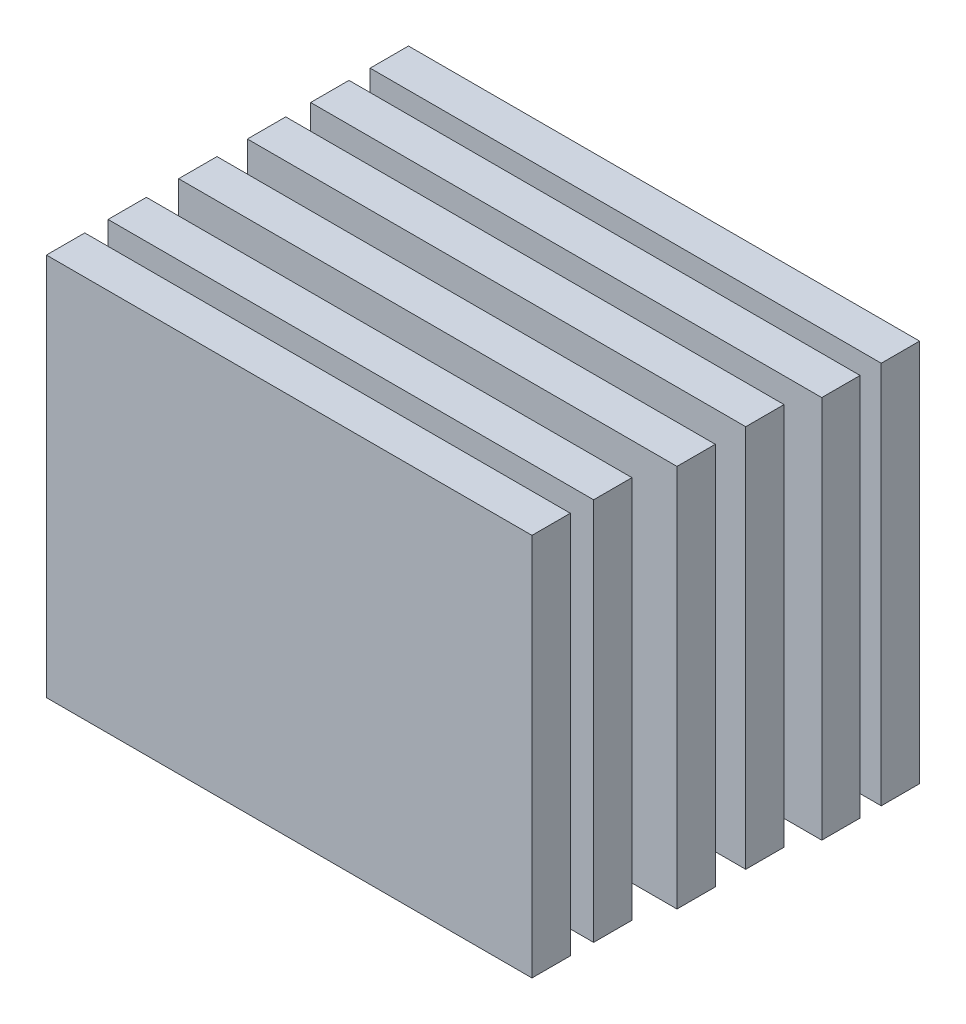
ISO-10303-21;
HEADER;
FILE_DESCRIPTION(('STEP AP214'),'2;1');
FILE_NAME('part.step','',(''),(''),'','','');
FILE_SCHEMA(('AUTOMOTIVE_DESIGN { 1 0 10303 214 1 1 1 1 }'));
ENDSEC;
DATA;
#1=APPLICATION_CONTEXT('core data for automotive mechanical design processes');
#2=APPLICATION_PROTOCOL_DEFINITION('international standard','automotive_design',2000,#1);
#3=PRODUCT_CONTEXT('',#1,'mechanical');
#4=PRODUCT('Part','Part','',(#3));
#5=PRODUCT_RELATED_PRODUCT_CATEGORY('part','',(#4));
#6=PRODUCT_DEFINITION_FORMATION('','',#4);
#7=PRODUCT_DEFINITION_CONTEXT('part definition',#1,'design');
#8=PRODUCT_DEFINITION('design','',#6,#7);
#9=PRODUCT_DEFINITION_SHAPE('','',#8);
#10=(LENGTH_UNIT() NAMED_UNIT(*) SI_UNIT(.MILLI.,.METRE.));
#11=(NAMED_UNIT(*) PLANE_ANGLE_UNIT() SI_UNIT($,.RADIAN.));
#12=(NAMED_UNIT(*) SI_UNIT($,.STERADIAN.) SOLID_ANGLE_UNIT());
#13=UNCERTAINTY_MEASURE_WITH_UNIT(LENGTH_MEASURE(1.E-05),#10,'distance_accuracy_value','');
#14=(GEOMETRIC_REPRESENTATION_CONTEXT(3) GLOBAL_UNCERTAINTY_ASSIGNED_CONTEXT((#13)) GLOBAL_UNIT_ASSIGNED_CONTEXT((#10,
#11,#12)) REPRESENTATION_CONTEXT('',''));
#15=CARTESIAN_POINT('',(0.,0.,0.));
#16=DIRECTION('',(0.,0.,1.));
#17=DIRECTION('',(1.,0.,0.));
#18=AXIS2_PLACEMENT_3D('',#15,#16,#17);
#19=CARTESIAN_POINT('',(0.,30.,-11.9864790685138));
#20=DIRECTION('',(1.,0.,0.));
#21=DIRECTION('',(0.,0.,-1.));
#22=AXIS2_PLACEMENT_3D('',#19,#20,#21);
#23=PLANE('',#22);
#24=DIRECTION('',(0.,0.,1.));
#25=VECTOR('',#24,1.);
#26=CARTESIAN_POINT('',(0.,0.,-11.9864790685138));
#27=LINE('',#26,#25);
#28=CARTESIAN_POINT('',(0.,0.,-14.9864790685138));
#29=VERTEX_POINT('',#28);
#30=CARTESIAN_POINT('',(0.,0.,-11.9864790685138));
#31=VERTEX_POINT('',#30);
#32=EDGE_CURVE('E107',#29,#31,#27,.T.);
#33=ORIENTED_EDGE('',*,*,#32,.T.);
#34=DIRECTION('',(0.,-1.,0.));
#35=VECTOR('',#34,1.);
#36=CARTESIAN_POINT('',(0.,30.,-11.9864790685138));
#37=LINE('',#36,#35);
#38=CARTESIAN_POINT('',(0.,30.,-11.9864790685138));
#39=VERTEX_POINT('',#38);
#40=EDGE_CURVE('E12',#39,#31,#37,.T.);
#41=ORIENTED_EDGE('',*,*,#40,.F.);
#42=DIRECTION('',(0.,0.,1.));
#43=VECTOR('',#42,1.);
#44=CARTESIAN_POINT('',(0.,30.,-11.9864790685138));
#45=LINE('',#44,#43);
#46=CARTESIAN_POINT('',(0.,30.,-14.9864790685138));
#47=VERTEX_POINT('',#46);
#48=EDGE_CURVE('E95',#47,#39,#45,.T.);
#49=ORIENTED_EDGE('',*,*,#48,.F.);
#50=DIRECTION('',(0.,-1.,0.));
#51=VECTOR('',#50,1.);
#52=CARTESIAN_POINT('',(0.,30.,-14.9864790685138));
#53=LINE('',#52,#51);
#54=EDGE_CURVE('E103',#47,#29,#53,.T.);
#55=ORIENTED_EDGE('',*,*,#54,.T.);
#56=EDGE_LOOP('',(#33,#41,#49,#55));
#57=FACE_BOUND('',#56,.T.);
#58=ADVANCED_FACE('F44',(#57),#23,.F.);
#59=CARTESIAN_POINT('',(0.,30.,-11.9864790685138));
#60=DIRECTION('',(0.,0.,-1.));
#61=DIRECTION('',(-1.,0.,0.));
#62=AXIS2_PLACEMENT_3D('',#59,#60,#61);
#63=PLANE('',#62);
#64=DIRECTION('',(1.,0.,0.));
#65=VECTOR('',#64,1.);
#66=CARTESIAN_POINT('',(0.,0.,-11.9864790685138));
#67=LINE('',#66,#65);
#68=CARTESIAN_POINT('',(40.,0.,-11.9864790685138));
#69=VERTEX_POINT('',#68);
#70=EDGE_CURVE('E99',#31,#69,#67,.T.);
#71=ORIENTED_EDGE('',*,*,#70,.T.);
#72=DIRECTION('',(0.,-1.,0.));
#73=VECTOR('',#72,1.);
#74=CARTESIAN_POINT('',(40.,30.,-11.9864790685138));
#75=LINE('',#74,#73);
#76=CARTESIAN_POINT('',(40.,30.,-11.9864790685138));
#77=VERTEX_POINT('',#76);
#78=EDGE_CURVE('E52',#77,#69,#75,.T.);
#79=ORIENTED_EDGE('',*,*,#78,.F.);
#80=DIRECTION('',(1.,0.,0.));
#81=VECTOR('',#80,1.);
#82=CARTESIAN_POINT('',(0.,30.,-11.9864790685138));
#83=LINE('',#82,#81);
#84=EDGE_CURVE('E90',#39,#77,#83,.T.);
#85=ORIENTED_EDGE('',*,*,#84,.F.);
#86=ORIENTED_EDGE('',*,*,#40,.T.);
#87=EDGE_LOOP('',(#71,#79,#85,#86));
#88=FACE_BOUND('',#87,.T.);
#89=ADVANCED_FACE('F98',(#88),#63,.F.);
#90=CARTESIAN_POINT('',(40.,30.,-11.9864790685138));
#91=DIRECTION('',(-1.,0.,0.));
#92=DIRECTION('',(0.,0.,1.));
#93=AXIS2_PLACEMENT_3D('',#90,#91,#92);
#94=PLANE('',#93);
#95=DIRECTION('',(0.,0.,-1.));
#96=VECTOR('',#95,1.);
#97=CARTESIAN_POINT('',(40.,0.,-11.9864790685138));
#98=LINE('',#97,#96);
#99=CARTESIAN_POINT('',(40.,0.,-14.9864790685138));
#100=VERTEX_POINT('',#99);
#101=EDGE_CURVE('E77',#69,#100,#98,.T.);
#102=ORIENTED_EDGE('',*,*,#101,.T.);
#103=DIRECTION('',(0.,-1.,0.));
#104=VECTOR('',#103,1.);
#105=CARTESIAN_POINT('',(40.,30.,-14.9864790685138));
#106=LINE('',#105,#104);
#107=CARTESIAN_POINT('',(40.,30.,-14.9864790685138));
#108=VERTEX_POINT('',#107);
#109=EDGE_CURVE('E100',#108,#100,#106,.T.);
#110=ORIENTED_EDGE('',*,*,#109,.F.);
#111=DIRECTION('',(0.,0.,-1.));
#112=VECTOR('',#111,1.);
#113=CARTESIAN_POINT('',(40.,30.,-11.9864790685138));
#114=LINE('',#113,#112);
#115=EDGE_CURVE('E93',#77,#108,#114,.T.);
#116=ORIENTED_EDGE('',*,*,#115,.F.);
#117=ORIENTED_EDGE('',*,*,#78,.T.);
#118=EDGE_LOOP('',(#102,#110,#116,#117));
#119=FACE_BOUND('',#118,.T.);
#120=ADVANCED_FACE('F101',(#119),#94,.F.);
#121=CARTESIAN_POINT('',(0.,30.,-14.9864790685138));
#122=DIRECTION('',(0.,0.,1.));
#123=DIRECTION('',(1.,0.,0.));
#124=AXIS2_PLACEMENT_3D('',#121,#122,#123);
#125=PLANE('',#124);
#126=DIRECTION('',(-1.,0.,0.));
#127=VECTOR('',#126,1.);
#128=CARTESIAN_POINT('',(0.,0.,-14.9864790685138));
#129=LINE('',#128,#127);
#130=EDGE_CURVE('E83',#100,#29,#129,.T.);
#131=ORIENTED_EDGE('',*,*,#130,.T.);
#132=ORIENTED_EDGE('',*,*,#54,.F.);
#133=DIRECTION('',(-1.,0.,0.));
#134=VECTOR('',#133,1.);
#135=CARTESIAN_POINT('',(0.,30.,-14.9864790685138));
#136=LINE('',#135,#134);
#137=EDGE_CURVE('E60',#108,#47,#136,.T.);
#138=ORIENTED_EDGE('',*,*,#137,.F.);
#139=ORIENTED_EDGE('',*,*,#109,.T.);
#140=EDGE_LOOP('',(#131,#132,#138,#139));
#141=FACE_BOUND('',#140,.T.);
#142=ADVANCED_FACE('F114',(#141),#125,.F.);
#143=CARTESIAN_POINT('',(0.,30.,0.));
#144=DIRECTION('',(0.,-1.,0.));
#145=DIRECTION('',(0.,0.,-1.));
#146=AXIS2_PLACEMENT_3D('',#143,#144,#145);
#147=PLANE('',#146);
#148=ORIENTED_EDGE('',*,*,#48,.T.);
#149=ORIENTED_EDGE('',*,*,#84,.T.);
#150=ORIENTED_EDGE('',*,*,#115,.T.);
#151=ORIENTED_EDGE('',*,*,#137,.T.);
#152=EDGE_LOOP('',(#148,#149,#150,#151));
#153=FACE_BOUND('',#152,.T.);
#154=ADVANCED_FACE('F91',(#153),#147,.F.);
#155=CARTESIAN_POINT('',(0.,0.,0.));
#156=DIRECTION('',(0.,-1.,0.));
#157=DIRECTION('',(0.,0.,-1.));
#158=AXIS2_PLACEMENT_3D('',#155,#156,#157);
#159=PLANE('',#158);
#160=ORIENTED_EDGE('',*,*,#32,.F.);
#161=ORIENTED_EDGE('',*,*,#130,.F.);
#162=ORIENTED_EDGE('',*,*,#101,.F.);
#163=ORIENTED_EDGE('',*,*,#70,.F.);
#164=EDGE_LOOP('',(#160,#161,#162,#163));
#165=FACE_BOUND('',#164,.T.);
#166=ADVANCED_FACE('F117',(#165),#159,.T.);
#167=CLOSED_SHELL('',(#58,#89,#120,#142,#154,#166));
#168=MANIFOLD_SOLID_BREP('B2',#167);
#169=CARTESIAN_POINT('',(0.,30.,10.3477883132481));
#170=DIRECTION('',(1.,0.,0.));
#171=DIRECTION('',(0.,0.,-1.));
#172=AXIS2_PLACEMENT_3D('',#169,#170,#171);
#173=PLANE('',#172);
#174=DIRECTION('',(0.,0.,1.));
#175=VECTOR('',#174,1.);
#176=CARTESIAN_POINT('',(0.,0.,10.3477883132481));
#177=LINE('',#176,#175);
#178=CARTESIAN_POINT('',(0.,0.,10.3477883132481));
#179=VERTEX_POINT('',#178);
#180=CARTESIAN_POINT('',(0.,0.,13.3477883132481));
#181=VERTEX_POINT('',#180);
#182=EDGE_CURVE('E241',#179,#181,#177,.T.);
#183=ORIENTED_EDGE('',*,*,#182,.T.);
#184=DIRECTION('',(0.,-1.,0.));
#185=VECTOR('',#184,1.);
#186=CARTESIAN_POINT('',(0.,30.,13.3477883132481));
#187=LINE('',#186,#185);
#188=CARTESIAN_POINT('',(0.,30.,13.3477883132481));
#189=VERTEX_POINT('',#188);
#190=EDGE_CURVE('E42',#189,#181,#187,.T.);
#191=ORIENTED_EDGE('',*,*,#190,.F.);
#192=DIRECTION('',(0.,0.,1.));
#193=VECTOR('',#192,1.);
#194=CARTESIAN_POINT('',(0.,30.,10.3477883132481));
#195=LINE('',#194,#193);
#196=CARTESIAN_POINT('',(0.,30.,10.3477883132481));
#197=VERTEX_POINT('',#196);
#198=EDGE_CURVE('E229',#197,#189,#195,.T.);
#199=ORIENTED_EDGE('',*,*,#198,.F.);
#200=DIRECTION('',(0.,-1.,0.));
#201=VECTOR('',#200,1.);
#202=CARTESIAN_POINT('',(0.,30.,10.3477883132481));
#203=LINE('',#202,#201);
#204=EDGE_CURVE('E237',#197,#179,#203,.T.);
#205=ORIENTED_EDGE('',*,*,#204,.T.);
#206=EDGE_LOOP('',(#183,#191,#199,#205));
#207=FACE_BOUND('',#206,.T.);
#208=ADVANCED_FACE('F178',(#207),#173,.F.);
#209=CARTESIAN_POINT('',(0.,30.,13.3477883132481));
#210=DIRECTION('',(0.,0.,-1.));
#211=DIRECTION('',(-1.,0.,0.));
#212=AXIS2_PLACEMENT_3D('',#209,#210,#211);
#213=PLANE('',#212);
#214=DIRECTION('',(1.,0.,0.));
#215=VECTOR('',#214,1.);
#216=CARTESIAN_POINT('',(0.,0.,13.3477883132481));
#217=LINE('',#216,#215);
#218=CARTESIAN_POINT('',(38.,0.,13.3477883132481));
#219=VERTEX_POINT('',#218);
#220=EDGE_CURVE('E233',#181,#219,#217,.T.);
#221=ORIENTED_EDGE('',*,*,#220,.T.);
#222=DIRECTION('',(0.,-1.,0.));
#223=VECTOR('',#222,1.);
#224=CARTESIAN_POINT('',(38.,30.,13.3477883132481));
#225=LINE('',#224,#223);
#226=CARTESIAN_POINT('',(38.,30.,13.3477883132481));
#227=VERTEX_POINT('',#226);
#228=EDGE_CURVE('E186',#227,#219,#225,.T.);
#229=ORIENTED_EDGE('',*,*,#228,.F.);
#230=DIRECTION('',(1.,0.,0.));
#231=VECTOR('',#230,1.);
#232=CARTESIAN_POINT('',(0.,30.,13.3477883132481));
#233=LINE('',#232,#231);
#234=EDGE_CURVE('E224',#189,#227,#233,.T.);
#235=ORIENTED_EDGE('',*,*,#234,.F.);
#236=ORIENTED_EDGE('',*,*,#190,.T.);
#237=EDGE_LOOP('',(#221,#229,#235,#236));
#238=FACE_BOUND('',#237,.T.);
#239=ADVANCED_FACE('F232',(#238),#213,.F.);
#240=CARTESIAN_POINT('',(38.,30.,10.3477883132481));
#241=DIRECTION('',(-1.,0.,0.));
#242=DIRECTION('',(0.,0.,1.));
#243=AXIS2_PLACEMENT_3D('',#240,#241,#242);
#244=PLANE('',#243);
#245=DIRECTION('',(0.,0.,-1.));
#246=VECTOR('',#245,1.);
#247=CARTESIAN_POINT('',(38.,0.,10.3477883132481));
#248=LINE('',#247,#246);
#249=CARTESIAN_POINT('',(38.,0.,10.3477883132481));
#250=VERTEX_POINT('',#249);
#251=EDGE_CURVE('E211',#219,#250,#248,.T.);
#252=ORIENTED_EDGE('',*,*,#251,.T.);
#253=DIRECTION('',(0.,-1.,0.));
#254=VECTOR('',#253,1.);
#255=CARTESIAN_POINT('',(38.,30.,10.3477883132481));
#256=LINE('',#255,#254);
#257=CARTESIAN_POINT('',(38.,30.,10.3477883132481));
#258=VERTEX_POINT('',#257);
#259=EDGE_CURVE('E234',#258,#250,#256,.T.);
#260=ORIENTED_EDGE('',*,*,#259,.F.);
#261=DIRECTION('',(0.,0.,-1.));
#262=VECTOR('',#261,1.);
#263=CARTESIAN_POINT('',(38.,30.,10.3477883132481));
#264=LINE('',#263,#262);
#265=EDGE_CURVE('E227',#227,#258,#264,.T.);
#266=ORIENTED_EDGE('',*,*,#265,.F.);
#267=ORIENTED_EDGE('',*,*,#228,.T.);
#268=EDGE_LOOP('',(#252,#260,#266,#267));
#269=FACE_BOUND('',#268,.T.);
#270=ADVANCED_FACE('F235',(#269),#244,.F.);
#271=CARTESIAN_POINT('',(0.,30.,10.3477883132481));
#272=DIRECTION('',(0.,0.,1.));
#273=DIRECTION('',(1.,0.,0.));
#274=AXIS2_PLACEMENT_3D('',#271,#272,#273);
#275=PLANE('',#274);
#276=DIRECTION('',(-1.,0.,0.));
#277=VECTOR('',#276,1.);
#278=CARTESIAN_POINT('',(0.,0.,10.3477883132481));
#279=LINE('',#278,#277);
#280=EDGE_CURVE('E217',#250,#179,#279,.T.);
#281=ORIENTED_EDGE('',*,*,#280,.T.);
#282=ORIENTED_EDGE('',*,*,#204,.F.);
#283=DIRECTION('',(-1.,0.,0.));
#284=VECTOR('',#283,1.);
#285=CARTESIAN_POINT('',(0.,30.,10.3477883132481));
#286=LINE('',#285,#284);
#287=EDGE_CURVE('E194',#258,#197,#286,.T.);
#288=ORIENTED_EDGE('',*,*,#287,.F.);
#289=ORIENTED_EDGE('',*,*,#259,.T.);
#290=EDGE_LOOP('',(#281,#282,#288,#289));
#291=FACE_BOUND('',#290,.T.);
#292=ADVANCED_FACE('F248',(#291),#275,.F.);
#293=CARTESIAN_POINT('',(0.,30.,0.));
#294=DIRECTION('',(0.,1.,0.));
#295=DIRECTION('',(0.,0.,1.));
#296=AXIS2_PLACEMENT_3D('',#293,#294,#295);
#297=PLANE('',#296);
#298=ORIENTED_EDGE('',*,*,#198,.T.);
#299=ORIENTED_EDGE('',*,*,#234,.T.);
#300=ORIENTED_EDGE('',*,*,#265,.T.);
#301=ORIENTED_EDGE('',*,*,#287,.T.);
#302=EDGE_LOOP('',(#298,#299,#300,#301));
#303=FACE_BOUND('',#302,.T.);
#304=ADVANCED_FACE('F225',(#303),#297,.T.);
#305=CARTESIAN_POINT('',(0.,0.,0.));
#306=DIRECTION('',(0.,1.,0.));
#307=DIRECTION('',(0.,0.,1.));
#308=AXIS2_PLACEMENT_3D('',#305,#306,#307);
#309=PLANE('',#308);
#310=ORIENTED_EDGE('',*,*,#182,.F.);
#311=ORIENTED_EDGE('',*,*,#280,.F.);
#312=ORIENTED_EDGE('',*,*,#251,.F.);
#313=ORIENTED_EDGE('',*,*,#220,.F.);
#314=EDGE_LOOP('',(#310,#311,#312,#313));
#315=FACE_BOUND('',#314,.T.);
#316=ADVANCED_FACE('F251',(#315),#309,.F.);
#317=CLOSED_SHELL('',(#208,#239,#270,#292,#304,#316));
#318=MANIFOLD_SOLID_BREP('B6',#317);
#319=CARTESIAN_POINT('',(0.,30.,-7.33061544992535));
#320=DIRECTION('',(1.,0.,0.));
#321=DIRECTION('',(0.,0.,-1.));
#322=AXIS2_PLACEMENT_3D('',#319,#320,#321);
#323=PLANE('',#322);
#324=DIRECTION('',(0.,0.,1.));
#325=VECTOR('',#324,1.);
#326=CARTESIAN_POINT('',(0.,0.,-7.33061544992535));
#327=LINE('',#326,#325);
#328=CARTESIAN_POINT('',(0.,0.,-10.3306154499254));
#329=VERTEX_POINT('',#328);
#330=CARTESIAN_POINT('',(0.,0.,-7.33061544992535));
#331=VERTEX_POINT('',#330);
#332=EDGE_CURVE('E375',#329,#331,#327,.T.);
#333=ORIENTED_EDGE('',*,*,#332,.T.);
#334=DIRECTION('',(0.,-1.,0.));
#335=VECTOR('',#334,1.);
#336=CARTESIAN_POINT('',(0.,30.,-7.33061544992535));
#337=LINE('',#336,#335);
#338=CARTESIAN_POINT('',(0.,30.,-7.33061544992535));
#339=VERTEX_POINT('',#338);
#340=EDGE_CURVE('E176',#339,#331,#337,.T.);
#341=ORIENTED_EDGE('',*,*,#340,.F.);
#342=DIRECTION('',(0.,0.,1.));
#343=VECTOR('',#342,1.);
#344=CARTESIAN_POINT('',(0.,30.,-7.33061544992535));
#345=LINE('',#344,#343);
#346=CARTESIAN_POINT('',(0.,30.,-10.3306154499254));
#347=VERTEX_POINT('',#346);
#348=EDGE_CURVE('E363',#347,#339,#345,.T.);
#349=ORIENTED_EDGE('',*,*,#348,.F.);
#350=DIRECTION('',(0.,-1.,0.));
#351=VECTOR('',#350,1.);
#352=CARTESIAN_POINT('',(0.,30.,-10.3306154499254));
#353=LINE('',#352,#351);
#354=EDGE_CURVE('E371',#347,#329,#353,.T.);
#355=ORIENTED_EDGE('',*,*,#354,.T.);
#356=EDGE_LOOP('',(#333,#341,#349,#355));
#357=FACE_BOUND('',#356,.T.);
#358=ADVANCED_FACE('F312',(#357),#323,.F.);
#359=CARTESIAN_POINT('',(0.,30.,-7.33061544992535));
#360=DIRECTION('',(0.,0.,-1.));
#361=DIRECTION('',(-1.,0.,0.));
#362=AXIS2_PLACEMENT_3D('',#359,#360,#361);
#363=PLANE('',#362);
#364=DIRECTION('',(1.,0.,0.));
#365=VECTOR('',#364,1.);
#366=CARTESIAN_POINT('',(0.,0.,-7.33061544992535));
#367=LINE('',#366,#365);
#368=CARTESIAN_POINT('',(40.,0.,-7.33061544992535));
#369=VERTEX_POINT('',#368);
#370=EDGE_CURVE('E367',#331,#369,#367,.T.);
#371=ORIENTED_EDGE('',*,*,#370,.T.);
#372=DIRECTION('',(0.,-1.,0.));
#373=VECTOR('',#372,1.);
#374=CARTESIAN_POINT('',(40.,30.,-7.33061544992535));
#375=LINE('',#374,#373);
#376=CARTESIAN_POINT('',(40.,30.,-7.33061544992535));
#377=VERTEX_POINT('',#376);
#378=EDGE_CURVE('E320',#377,#369,#375,.T.);
#379=ORIENTED_EDGE('',*,*,#378,.F.);
#380=DIRECTION('',(1.,0.,0.));
#381=VECTOR('',#380,1.);
#382=CARTESIAN_POINT('',(0.,30.,-7.33061544992535));
#383=LINE('',#382,#381);
#384=EDGE_CURVE('E358',#339,#377,#383,.T.);
#385=ORIENTED_EDGE('',*,*,#384,.F.);
#386=ORIENTED_EDGE('',*,*,#340,.T.);
#387=EDGE_LOOP('',(#371,#379,#385,#386));
#388=FACE_BOUND('',#387,.T.);
#389=ADVANCED_FACE('F366',(#388),#363,.F.);
#390=CARTESIAN_POINT('',(40.,30.,-7.33061544992535));
#391=DIRECTION('',(-1.,0.,0.));
#392=DIRECTION('',(0.,0.,1.));
#393=AXIS2_PLACEMENT_3D('',#390,#391,#392);
#394=PLANE('',#393);
#395=DIRECTION('',(0.,0.,-1.));
#396=VECTOR('',#395,1.);
#397=CARTESIAN_POINT('',(40.,0.,-7.33061544992535));
#398=LINE('',#397,#396);
#399=CARTESIAN_POINT('',(40.,0.,-10.3306154499254));
#400=VERTEX_POINT('',#399);
#401=EDGE_CURVE('E345',#369,#400,#398,.T.);
#402=ORIENTED_EDGE('',*,*,#401,.T.);
#403=DIRECTION('',(0.,-1.,0.));
#404=VECTOR('',#403,1.);
#405=CARTESIAN_POINT('',(40.,30.,-10.3306154499254));
#406=LINE('',#405,#404);
#407=CARTESIAN_POINT('',(40.,30.,-10.3306154499254));
#408=VERTEX_POINT('',#407);
#409=EDGE_CURVE('E368',#408,#400,#406,.T.);
#410=ORIENTED_EDGE('',*,*,#409,.F.);
#411=DIRECTION('',(0.,0.,-1.));
#412=VECTOR('',#411,1.);
#413=CARTESIAN_POINT('',(40.,30.,-7.33061544992535));
#414=LINE('',#413,#412);
#415=EDGE_CURVE('E361',#377,#408,#414,.T.);
#416=ORIENTED_EDGE('',*,*,#415,.F.);
#417=ORIENTED_EDGE('',*,*,#378,.T.);
#418=EDGE_LOOP('',(#402,#410,#416,#417));
#419=FACE_BOUND('',#418,.T.);
#420=ADVANCED_FACE('F369',(#419),#394,.F.);
#421=CARTESIAN_POINT('',(0.,30.,-10.3306154499254));
#422=DIRECTION('',(0.,0.,1.));
#423=DIRECTION('',(1.,0.,0.));
#424=AXIS2_PLACEMENT_3D('',#421,#422,#423);
#425=PLANE('',#424);
#426=DIRECTION('',(-1.,0.,0.));
#427=VECTOR('',#426,1.);
#428=CARTESIAN_POINT('',(0.,0.,-10.3306154499254));
#429=LINE('',#428,#427);
#430=EDGE_CURVE('E351',#400,#329,#429,.T.);
#431=ORIENTED_EDGE('',*,*,#430,.T.);
#432=ORIENTED_EDGE('',*,*,#354,.F.);
#433=DIRECTION('',(-1.,0.,0.));
#434=VECTOR('',#433,1.);
#435=CARTESIAN_POINT('',(0.,30.,-10.3306154499254));
#436=LINE('',#435,#434);
#437=EDGE_CURVE('E328',#408,#347,#436,.T.);
#438=ORIENTED_EDGE('',*,*,#437,.F.);
#439=ORIENTED_EDGE('',*,*,#409,.T.);
#440=EDGE_LOOP('',(#431,#432,#438,#439));
#441=FACE_BOUND('',#440,.T.);
#442=ADVANCED_FACE('F382',(#441),#425,.F.);
#443=CARTESIAN_POINT('',(0.,30.,0.));
#444=DIRECTION('',(0.,-1.,0.));
#445=DIRECTION('',(0.,0.,-1.));
#446=AXIS2_PLACEMENT_3D('',#443,#444,#445);
#447=PLANE('',#446);
#448=ORIENTED_EDGE('',*,*,#348,.T.);
#449=ORIENTED_EDGE('',*,*,#384,.T.);
#450=ORIENTED_EDGE('',*,*,#415,.T.);
#451=ORIENTED_EDGE('',*,*,#437,.T.);
#452=EDGE_LOOP('',(#448,#449,#450,#451));
#453=FACE_BOUND('',#452,.T.);
#454=ADVANCED_FACE('F359',(#453),#447,.F.);
#455=CARTESIAN_POINT('',(0.,0.,0.));
#456=DIRECTION('',(0.,-1.,0.));
#457=DIRECTION('',(0.,0.,-1.));
#458=AXIS2_PLACEMENT_3D('',#455,#456,#457);
#459=PLANE('',#458);
#460=ORIENTED_EDGE('',*,*,#332,.F.);
#461=ORIENTED_EDGE('',*,*,#430,.F.);
#462=ORIENTED_EDGE('',*,*,#401,.F.);
#463=ORIENTED_EDGE('',*,*,#370,.F.);
#464=EDGE_LOOP('',(#460,#461,#462,#463));
#465=FACE_BOUND('',#464,.T.);
#466=ADVANCED_FACE('F385',(#465),#459,.T.);
#467=CLOSED_SHELL('',(#358,#389,#420,#442,#454,#466));
#468=MANIFOLD_SOLID_BREP('B36',#467);
#469=CARTESIAN_POINT('',(0.,30.,-2.38095238095238));
#470=DIRECTION('',(1.,0.,0.));
#471=DIRECTION('',(0.,0.,-1.));
#472=AXIS2_PLACEMENT_3D('',#469,#470,#471);
#473=PLANE('',#472);
#474=DIRECTION('',(0.,0.,1.));
#475=VECTOR('',#474,1.);
#476=CARTESIAN_POINT('',(0.,0.,-2.38095238095238));
#477=LINE('',#476,#475);
#478=CARTESIAN_POINT('',(0.,0.,-5.38095238095238));
#479=VERTEX_POINT('',#478);
#480=CARTESIAN_POINT('',(0.,0.,-2.38095238095238));
#481=VERTEX_POINT('',#480);
#482=EDGE_CURVE('E509',#479,#481,#477,.T.);
#483=ORIENTED_EDGE('',*,*,#482,.T.);
#484=DIRECTION('',(0.,-1.,0.));
#485=VECTOR('',#484,1.);
#486=CARTESIAN_POINT('',(0.,30.,-2.38095238095238));
#487=LINE('',#486,#485);
#488=CARTESIAN_POINT('',(0.,30.,-2.38095238095238));
#489=VERTEX_POINT('',#488);
#490=EDGE_CURVE('E310',#489,#481,#487,.T.);
#491=ORIENTED_EDGE('',*,*,#490,.F.);
#492=DIRECTION('',(0.,0.,1.));
#493=VECTOR('',#492,1.);
#494=CARTESIAN_POINT('',(0.,30.,-2.38095238095238));
#495=LINE('',#494,#493);
#496=CARTESIAN_POINT('',(0.,30.,-5.38095238095238));
#497=VERTEX_POINT('',#496);
#498=EDGE_CURVE('E497',#497,#489,#495,.T.);
#499=ORIENTED_EDGE('',*,*,#498,.F.);
#500=DIRECTION('',(0.,-1.,0.));
#501=VECTOR('',#500,1.);
#502=CARTESIAN_POINT('',(0.,30.,-5.38095238095238));
#503=LINE('',#502,#501);
#504=EDGE_CURVE('E505',#497,#479,#503,.T.);
#505=ORIENTED_EDGE('',*,*,#504,.T.);
#506=EDGE_LOOP('',(#483,#491,#499,#505));
#507=FACE_BOUND('',#506,.T.);
#508=ADVANCED_FACE('F446',(#507),#473,.F.);
#509=CARTESIAN_POINT('',(0.,30.,-2.38095238095238));
#510=DIRECTION('',(0.,0.,-1.));
#511=DIRECTION('',(-1.,0.,0.));
#512=AXIS2_PLACEMENT_3D('',#509,#510,#511);
#513=PLANE('',#512);
#514=DIRECTION('',(1.,0.,0.));
#515=VECTOR('',#514,1.);
#516=CARTESIAN_POINT('',(0.,0.,-2.38095238095238));
#517=LINE('',#516,#515);
#518=CARTESIAN_POINT('',(39.,0.,-2.38095238095238));
#519=VERTEX_POINT('',#518);
#520=EDGE_CURVE('E501',#481,#519,#517,.T.);
#521=ORIENTED_EDGE('',*,*,#520,.T.);
#522=DIRECTION('',(0.,-1.,0.));
#523=VECTOR('',#522,1.);
#524=CARTESIAN_POINT('',(39.,30.,-2.38095238095238));
#525=LINE('',#524,#523);
#526=CARTESIAN_POINT('',(39.,30.,-2.38095238095238));
#527=VERTEX_POINT('',#526);
#528=EDGE_CURVE('E454',#527,#519,#525,.T.);
#529=ORIENTED_EDGE('',*,*,#528,.F.);
#530=DIRECTION('',(1.,0.,0.));
#531=VECTOR('',#530,1.);
#532=CARTESIAN_POINT('',(0.,30.,-2.38095238095238));
#533=LINE('',#532,#531);
#534=EDGE_CURVE('E492',#489,#527,#533,.T.);
#535=ORIENTED_EDGE('',*,*,#534,.F.);
#536=ORIENTED_EDGE('',*,*,#490,.T.);
#537=EDGE_LOOP('',(#521,#529,#535,#536));
#538=FACE_BOUND('',#537,.T.);
#539=ADVANCED_FACE('F500',(#538),#513,.F.);
#540=CARTESIAN_POINT('',(39.,30.,-2.38095238095238));
#541=DIRECTION('',(-1.,0.,0.));
#542=DIRECTION('',(0.,0.,1.));
#543=AXIS2_PLACEMENT_3D('',#540,#541,#542);
#544=PLANE('',#543);
#545=DIRECTION('',(0.,0.,-1.));
#546=VECTOR('',#545,1.);
#547=CARTESIAN_POINT('',(39.,0.,-2.38095238095238));
#548=LINE('',#547,#546);
#549=CARTESIAN_POINT('',(39.,0.,-5.38095238095238));
#550=VERTEX_POINT('',#549);
#551=EDGE_CURVE('E479',#519,#550,#548,.T.);
#552=ORIENTED_EDGE('',*,*,#551,.T.);
#553=DIRECTION('',(0.,-1.,0.));
#554=VECTOR('',#553,1.);
#555=CARTESIAN_POINT('',(39.,30.,-5.38095238095238));
#556=LINE('',#555,#554);
#557=CARTESIAN_POINT('',(39.,30.,-5.38095238095238));
#558=VERTEX_POINT('',#557);
#559=EDGE_CURVE('E502',#558,#550,#556,.T.);
#560=ORIENTED_EDGE('',*,*,#559,.F.);
#561=DIRECTION('',(0.,0.,-1.));
#562=VECTOR('',#561,1.);
#563=CARTESIAN_POINT('',(39.,30.,-2.38095238095238));
#564=LINE('',#563,#562);
#565=EDGE_CURVE('E495',#527,#558,#564,.T.);
#566=ORIENTED_EDGE('',*,*,#565,.F.);
#567=ORIENTED_EDGE('',*,*,#528,.T.);
#568=EDGE_LOOP('',(#552,#560,#566,#567));
#569=FACE_BOUND('',#568,.T.);
#570=ADVANCED_FACE('F503',(#569),#544,.F.);
#571=CARTESIAN_POINT('',(0.,30.,-5.38095238095238));
#572=DIRECTION('',(0.,0.,1.));
#573=DIRECTION('',(1.,0.,0.));
#574=AXIS2_PLACEMENT_3D('',#571,#572,#573);
#575=PLANE('',#574);
#576=DIRECTION('',(-1.,0.,0.));
#577=VECTOR('',#576,1.);
#578=CARTESIAN_POINT('',(0.,0.,-5.38095238095238));
#579=LINE('',#578,#577);
#580=EDGE_CURVE('E485',#550,#479,#579,.T.);
#581=ORIENTED_EDGE('',*,*,#580,.T.);
#582=ORIENTED_EDGE('',*,*,#504,.F.);
#583=DIRECTION('',(-1.,0.,0.));
#584=VECTOR('',#583,1.);
#585=CARTESIAN_POINT('',(0.,30.,-5.38095238095238));
#586=LINE('',#585,#584);
#587=EDGE_CURVE('E462',#558,#497,#586,.T.);
#588=ORIENTED_EDGE('',*,*,#587,.F.);
#589=ORIENTED_EDGE('',*,*,#559,.T.);
#590=EDGE_LOOP('',(#581,#582,#588,#589));
#591=FACE_BOUND('',#590,.T.);
#592=ADVANCED_FACE('F516',(#591),#575,.F.);
#593=CARTESIAN_POINT('',(0.,30.,0.));
#594=DIRECTION('',(0.,-1.,0.));
#595=DIRECTION('',(0.,0.,-1.));
#596=AXIS2_PLACEMENT_3D('',#593,#594,#595);
#597=PLANE('',#596);
#598=ORIENTED_EDGE('',*,*,#498,.T.);
#599=ORIENTED_EDGE('',*,*,#534,.T.);
#600=ORIENTED_EDGE('',*,*,#565,.T.);
#601=ORIENTED_EDGE('',*,*,#587,.T.);
#602=EDGE_LOOP('',(#598,#599,#600,#601));
#603=FACE_BOUND('',#602,.T.);
#604=ADVANCED_FACE('F493',(#603),#597,.F.);
#605=CARTESIAN_POINT('',(0.,0.,0.));
#606=DIRECTION('',(0.,-1.,0.));
#607=DIRECTION('',(0.,0.,-1.));
#608=AXIS2_PLACEMENT_3D('',#605,#606,#607);
#609=PLANE('',#608);
#610=ORIENTED_EDGE('',*,*,#482,.F.);
#611=ORIENTED_EDGE('',*,*,#580,.F.);
#612=ORIENTED_EDGE('',*,*,#551,.F.);
#613=ORIENTED_EDGE('',*,*,#520,.F.);
#614=EDGE_LOOP('',(#610,#611,#612,#613));
#615=FACE_BOUND('',#614,.T.);
#616=ADVANCED_FACE('F519',(#615),#609,.T.);
#617=CLOSED_SHELL('',(#508,#539,#570,#592,#604,#616));
#618=MANIFOLD_SOLID_BREP('B170',#617);
#619=CARTESIAN_POINT('',(0.,30.,5.52380952380952));
#620=DIRECTION('',(1.,0.,0.));
#621=DIRECTION('',(0.,0.,-1.));
#622=AXIS2_PLACEMENT_3D('',#619,#620,#621);
#623=PLANE('',#622);
#624=DIRECTION('',(0.,0.,1.));
#625=VECTOR('',#624,1.);
#626=CARTESIAN_POINT('',(0.,0.,5.52380952380952));
#627=LINE('',#626,#625);
#628=CARTESIAN_POINT('',(0.,0.,5.52380952380952));
#629=VERTEX_POINT('',#628);
#630=CARTESIAN_POINT('',(0.,0.,8.52380952380952));
#631=VERTEX_POINT('',#630);
#632=EDGE_CURVE('E642',#629,#631,#627,.T.);
#633=ORIENTED_EDGE('',*,*,#632,.T.);
#634=DIRECTION('',(0.,-1.,0.));
#635=VECTOR('',#634,1.);
#636=CARTESIAN_POINT('',(0.,30.,8.52380952380952));
#637=LINE('',#636,#635);
#638=CARTESIAN_POINT('',(0.,30.,8.52380952380952));
#639=VERTEX_POINT('',#638);
#640=EDGE_CURVE('E444',#639,#631,#637,.T.);
#641=ORIENTED_EDGE('',*,*,#640,.F.);
#642=DIRECTION('',(0.,0.,1.));
#643=VECTOR('',#642,1.);
#644=CARTESIAN_POINT('',(0.,30.,5.52380952380952));
#645=LINE('',#644,#643);
#646=CARTESIAN_POINT('',(0.,30.,5.52380952380952));
#647=VERTEX_POINT('',#646);
#648=EDGE_CURVE('E630',#647,#639,#645,.T.);
#649=ORIENTED_EDGE('',*,*,#648,.F.);
#650=DIRECTION('',(0.,-1.,0.));
#651=VECTOR('',#650,1.);
#652=CARTESIAN_POINT('',(0.,30.,5.52380952380952));
#653=LINE('',#652,#651);
#654=EDGE_CURVE('E638',#647,#629,#653,.T.);
#655=ORIENTED_EDGE('',*,*,#654,.T.);
#656=EDGE_LOOP('',(#633,#641,#649,#655));
#657=FACE_BOUND('',#656,.T.);
#658=ADVANCED_FACE('F579',(#657),#623,.F.);
#659=CARTESIAN_POINT('',(0.,30.,8.52380952380952));
#660=DIRECTION('',(0.,0.,-1.));
#661=DIRECTION('',(-1.,0.,0.));
#662=AXIS2_PLACEMENT_3D('',#659,#660,#661);
#663=PLANE('',#662);
#664=DIRECTION('',(1.,0.,0.));
#665=VECTOR('',#664,1.);
#666=CARTESIAN_POINT('',(0.,0.,8.52380952380952));
#667=LINE('',#666,#665);
#668=CARTESIAN_POINT('',(38.,0.,8.52380952380952));
#669=VERTEX_POINT('',#668);
#670=EDGE_CURVE('E634',#631,#669,#667,.T.);
#671=ORIENTED_EDGE('',*,*,#670,.T.);
#672=DIRECTION('',(0.,-1.,0.));
#673=VECTOR('',#672,1.);
#674=CARTESIAN_POINT('',(38.,30.,8.52380952380952));
#675=LINE('',#674,#673);
#676=CARTESIAN_POINT('',(38.,30.,8.52380952380952));
#677=VERTEX_POINT('',#676);
#678=EDGE_CURVE('E587',#677,#669,#675,.T.);
#679=ORIENTED_EDGE('',*,*,#678,.F.);
#680=DIRECTION('',(1.,0.,0.));
#681=VECTOR('',#680,1.);
#682=CARTESIAN_POINT('',(0.,30.,8.52380952380952));
#683=LINE('',#682,#681);
#684=EDGE_CURVE('E625',#639,#677,#683,.T.);
#685=ORIENTED_EDGE('',*,*,#684,.F.);
#686=ORIENTED_EDGE('',*,*,#640,.T.);
#687=EDGE_LOOP('',(#671,#679,#685,#686));
#688=FACE_BOUND('',#687,.T.);
#689=ADVANCED_FACE('F633',(#688),#663,.F.);
#690=CARTESIAN_POINT('',(38.,30.,5.52380952380952));
#691=DIRECTION('',(-1.,0.,0.));
#692=DIRECTION('',(0.,0.,1.));
#693=AXIS2_PLACEMENT_3D('',#690,#691,#692);
#694=PLANE('',#693);
#695=DIRECTION('',(0.,0.,-1.));
#696=VECTOR('',#695,1.);
#697=CARTESIAN_POINT('',(38.,0.,5.52380952380952));
#698=LINE('',#697,#696);
#699=CARTESIAN_POINT('',(38.,0.,5.52380952380952));
#700=VERTEX_POINT('',#699);
#701=EDGE_CURVE('E612',#669,#700,#698,.T.);
#702=ORIENTED_EDGE('',*,*,#701,.T.);
#703=DIRECTION('',(0.,-1.,0.));
#704=VECTOR('',#703,1.);
#705=CARTESIAN_POINT('',(38.,30.,5.52380952380952));
#706=LINE('',#705,#704);
#707=CARTESIAN_POINT('',(38.,30.,5.52380952380952));
#708=VERTEX_POINT('',#707);
#709=EDGE_CURVE('E635',#708,#700,#706,.T.);
#710=ORIENTED_EDGE('',*,*,#709,.F.);
#711=DIRECTION('',(0.,0.,-1.));
#712=VECTOR('',#711,1.);
#713=CARTESIAN_POINT('',(38.,30.,5.52380952380952));
#714=LINE('',#713,#712);
#715=EDGE_CURVE('E628',#677,#708,#714,.T.);
#716=ORIENTED_EDGE('',*,*,#715,.F.);
#717=ORIENTED_EDGE('',*,*,#678,.T.);
#718=EDGE_LOOP('',(#702,#710,#716,#717));
#719=FACE_BOUND('',#718,.T.);
#720=ADVANCED_FACE('F636',(#719),#694,.F.);
#721=CARTESIAN_POINT('',(0.,30.,5.52380952380952));
#722=DIRECTION('',(0.,0.,1.));
#723=DIRECTION('',(1.,0.,0.));
#724=AXIS2_PLACEMENT_3D('',#721,#722,#723);
#725=PLANE('',#724);
#726=DIRECTION('',(-1.,0.,0.));
#727=VECTOR('',#726,1.);
#728=CARTESIAN_POINT('',(0.,0.,5.52380952380952));
#729=LINE('',#728,#727);
#730=EDGE_CURVE('E618',#700,#629,#729,.T.);
#731=ORIENTED_EDGE('',*,*,#730,.T.);
#732=ORIENTED_EDGE('',*,*,#654,.F.);
#733=DIRECTION('',(-1.,0.,0.));
#734=VECTOR('',#733,1.);
#735=CARTESIAN_POINT('',(0.,30.,5.52380952380952));
#736=LINE('',#735,#734);
#737=EDGE_CURVE('E595',#708,#647,#736,.T.);
#738=ORIENTED_EDGE('',*,*,#737,.F.);
#739=ORIENTED_EDGE('',*,*,#709,.T.);
#740=EDGE_LOOP('',(#731,#732,#738,#739));
#741=FACE_BOUND('',#740,.T.);
#742=ADVANCED_FACE('F649',(#741),#725,.F.);
#743=CARTESIAN_POINT('',(0.,30.,0.));
#744=DIRECTION('',(0.,1.,0.));
#745=DIRECTION('',(0.,0.,1.));
#746=AXIS2_PLACEMENT_3D('',#743,#744,#745);
#747=PLANE('',#746);
#748=ORIENTED_EDGE('',*,*,#648,.T.);
#749=ORIENTED_EDGE('',*,*,#684,.T.);
#750=ORIENTED_EDGE('',*,*,#715,.T.);
#751=ORIENTED_EDGE('',*,*,#737,.T.);
#752=EDGE_LOOP('',(#748,#749,#750,#751));
#753=FACE_BOUND('',#752,.T.);
#754=ADVANCED_FACE('F626',(#753),#747,.T.);
#755=CARTESIAN_POINT('',(0.,0.,0.));
#756=DIRECTION('',(0.,1.,0.));
#757=DIRECTION('',(0.,0.,1.));
#758=AXIS2_PLACEMENT_3D('',#755,#756,#757);
#759=PLANE('',#758);
#760=ORIENTED_EDGE('',*,*,#632,.F.);
#761=ORIENTED_EDGE('',*,*,#730,.F.);
#762=ORIENTED_EDGE('',*,*,#701,.F.);
#763=ORIENTED_EDGE('',*,*,#670,.F.);
#764=EDGE_LOOP('',(#760,#761,#762,#763));
#765=FACE_BOUND('',#764,.T.);
#766=ADVANCED_FACE('F652',(#765),#759,.F.);
#767=CLOSED_SHELL('',(#658,#689,#720,#742,#754,#766));
#768=MANIFOLD_SOLID_BREP('B304',#767);
#769=CARTESIAN_POINT('',(0.,30.,0.));
#770=DIRECTION('',(1.,0.,0.));
#771=DIRECTION('',(0.,0.,-1.));
#772=AXIS2_PLACEMENT_3D('',#769,#770,#771);
#773=PLANE('',#772);
#774=DIRECTION('',(0.,0.,1.));
#775=VECTOR('',#774,1.);
#776=CARTESIAN_POINT('',(0.,0.,0.));
#777=LINE('',#776,#775);
#778=CARTESIAN_POINT('',(0.,0.,0.));
#779=VERTEX_POINT('',#778);
#780=CARTESIAN_POINT('',(0.,0.,3.));
#781=VERTEX_POINT('',#780);
#782=EDGE_CURVE('E766',#779,#781,#777,.T.);
#783=ORIENTED_EDGE('',*,*,#782,.T.);
#784=DIRECTION('',(0.,-1.,0.));
#785=VECTOR('',#784,1.);
#786=CARTESIAN_POINT('',(0.,30.,3.));
#787=LINE('',#786,#785);
#788=CARTESIAN_POINT('',(0.,30.,3.));
#789=VERTEX_POINT('',#788);
#790=EDGE_CURVE('E577',#789,#781,#787,.T.);
#791=ORIENTED_EDGE('',*,*,#790,.F.);
#792=DIRECTION('',(0.,0.,1.));
#793=VECTOR('',#792,1.);
#794=CARTESIAN_POINT('',(0.,30.,0.));
#795=LINE('',#794,#793);
#796=CARTESIAN_POINT('',(0.,30.,0.));
#797=VERTEX_POINT('',#796);
#798=EDGE_CURVE('E754',#797,#789,#795,.T.);
#799=ORIENTED_EDGE('',*,*,#798,.F.);
#800=DIRECTION('',(0.,-1.,0.));
#801=VECTOR('',#800,1.);
#802=CARTESIAN_POINT('',(0.,30.,0.));
#803=LINE('',#802,#801);
#804=EDGE_CURVE('E762',#797,#779,#803,.T.);
#805=ORIENTED_EDGE('',*,*,#804,.T.);
#806=EDGE_LOOP('',(#783,#791,#799,#805));
#807=FACE_BOUND('',#806,.T.);
#808=ADVANCED_FACE('F703',(#807),#773,.F.);
#809=CARTESIAN_POINT('',(0.,30.,3.));
#810=DIRECTION('',(0.,0.,-1.));
#811=DIRECTION('',(-1.,0.,0.));
#812=AXIS2_PLACEMENT_3D('',#809,#810,#811);
#813=PLANE('',#812);
#814=DIRECTION('',(1.,0.,0.));
#815=VECTOR('',#814,1.);
#816=CARTESIAN_POINT('',(0.,0.,3.));
#817=LINE('',#816,#815);
#818=CARTESIAN_POINT('',(39.,0.,3.));
#819=VERTEX_POINT('',#818);
#820=EDGE_CURVE('E758',#781,#819,#817,.T.);
#821=ORIENTED_EDGE('',*,*,#820,.T.);
#822=DIRECTION('',(0.,-1.,0.));
#823=VECTOR('',#822,1.);
#824=CARTESIAN_POINT('',(39.,30.,3.));
#825=LINE('',#824,#823);
#826=CARTESIAN_POINT('',(39.,30.,3.));
#827=VERTEX_POINT('',#826);
#828=EDGE_CURVE('E711',#827,#819,#825,.T.);
#829=ORIENTED_EDGE('',*,*,#828,.F.);
#830=DIRECTION('',(1.,0.,0.));
#831=VECTOR('',#830,1.);
#832=CARTESIAN_POINT('',(0.,30.,3.));
#833=LINE('',#832,#831);
#834=EDGE_CURVE('E749',#789,#827,#833,.T.);
#835=ORIENTED_EDGE('',*,*,#834,.F.);
#836=ORIENTED_EDGE('',*,*,#790,.T.);
#837=EDGE_LOOP('',(#821,#829,#835,#836));
#838=FACE_BOUND('',#837,.T.);
#839=ADVANCED_FACE('F757',(#838),#813,.F.);
#840=CARTESIAN_POINT('',(39.,30.,0.));
#841=DIRECTION('',(-1.,0.,0.));
#842=DIRECTION('',(0.,0.,1.));
#843=AXIS2_PLACEMENT_3D('',#840,#841,#842);
#844=PLANE('',#843);
#845=DIRECTION('',(0.,0.,-1.));
#846=VECTOR('',#845,1.);
#847=CARTESIAN_POINT('',(39.,0.,0.));
#848=LINE('',#847,#846);
#849=CARTESIAN_POINT('',(39.,0.,0.));
#850=VERTEX_POINT('',#849);
#851=EDGE_CURVE('E736',#819,#850,#848,.T.);
#852=ORIENTED_EDGE('',*,*,#851,.T.);
#853=DIRECTION('',(0.,-1.,0.));
#854=VECTOR('',#853,1.);
#855=CARTESIAN_POINT('',(39.,30.,0.));
#856=LINE('',#855,#854);
#857=CARTESIAN_POINT('',(39.,30.,0.));
#858=VERTEX_POINT('',#857);
#859=EDGE_CURVE('E759',#858,#850,#856,.T.);
#860=ORIENTED_EDGE('',*,*,#859,.F.);
#861=DIRECTION('',(0.,0.,-1.));
#862=VECTOR('',#861,1.);
#863=CARTESIAN_POINT('',(39.,30.,0.));
#864=LINE('',#863,#862);
#865=EDGE_CURVE('E752',#827,#858,#864,.T.);
#866=ORIENTED_EDGE('',*,*,#865,.F.);
#867=ORIENTED_EDGE('',*,*,#828,.T.);
#868=EDGE_LOOP('',(#852,#860,#866,#867));
#869=FACE_BOUND('',#868,.T.);
#870=ADVANCED_FACE('F760',(#869),#844,.F.);
#871=CARTESIAN_POINT('',(0.,30.,0.));
#872=DIRECTION('',(0.,0.,1.));
#873=DIRECTION('',(1.,0.,0.));
#874=AXIS2_PLACEMENT_3D('',#871,#872,#873);
#875=PLANE('',#874);
#876=DIRECTION('',(-1.,0.,0.));
#877=VECTOR('',#876,1.);
#878=CARTESIAN_POINT('',(0.,0.,0.));
#879=LINE('',#878,#877);
#880=EDGE_CURVE('E742',#850,#779,#879,.T.);
#881=ORIENTED_EDGE('',*,*,#880,.T.);
#882=ORIENTED_EDGE('',*,*,#804,.F.);
#883=DIRECTION('',(-1.,0.,0.));
#884=VECTOR('',#883,1.);
#885=CARTESIAN_POINT('',(0.,30.,0.));
#886=LINE('',#885,#884);
#887=EDGE_CURVE('E719',#858,#797,#886,.T.);
#888=ORIENTED_EDGE('',*,*,#887,.F.);
#889=ORIENTED_EDGE('',*,*,#859,.T.);
#890=EDGE_LOOP('',(#881,#882,#888,#889));
#891=FACE_BOUND('',#890,.T.);
#892=ADVANCED_FACE('F773',(#891),#875,.F.);
#893=CARTESIAN_POINT('',(0.,30.,0.));
#894=DIRECTION('',(0.,1.,0.));
#895=DIRECTION('',(0.,0.,1.));
#896=AXIS2_PLACEMENT_3D('',#893,#894,#895);
#897=PLANE('',#896);
#898=ORIENTED_EDGE('',*,*,#798,.T.);
#899=ORIENTED_EDGE('',*,*,#834,.T.);
#900=ORIENTED_EDGE('',*,*,#865,.T.);
#901=ORIENTED_EDGE('',*,*,#887,.T.);
#902=EDGE_LOOP('',(#898,#899,#900,#901));
#903=FACE_BOUND('',#902,.T.);
#904=ADVANCED_FACE('F750',(#903),#897,.T.);
#905=CARTESIAN_POINT('',(0.,0.,0.));
#906=DIRECTION('',(0.,1.,0.));
#907=DIRECTION('',(0.,0.,1.));
#908=AXIS2_PLACEMENT_3D('',#905,#906,#907);
#909=PLANE('',#908);
#910=ORIENTED_EDGE('',*,*,#782,.F.);
#911=ORIENTED_EDGE('',*,*,#880,.F.);
#912=ORIENTED_EDGE('',*,*,#851,.F.);
#913=ORIENTED_EDGE('',*,*,#820,.F.);
#914=EDGE_LOOP('',(#910,#911,#912,#913));
#915=FACE_BOUND('',#914,.T.);
#916=ADVANCED_FACE('F776',(#915),#909,.F.);
#917=CLOSED_SHELL('',(#808,#839,#870,#892,#904,#916));
#918=MANIFOLD_SOLID_BREP('B438',#917);
#919=ADVANCED_BREP_SHAPE_REPRESENTATION('',(#18,#168,#318,#468,#618,#768,#918),#14);
#920=SHAPE_DEFINITION_REPRESENTATION(#9,#919);
ENDSEC;
END-ISO-10303-21;
